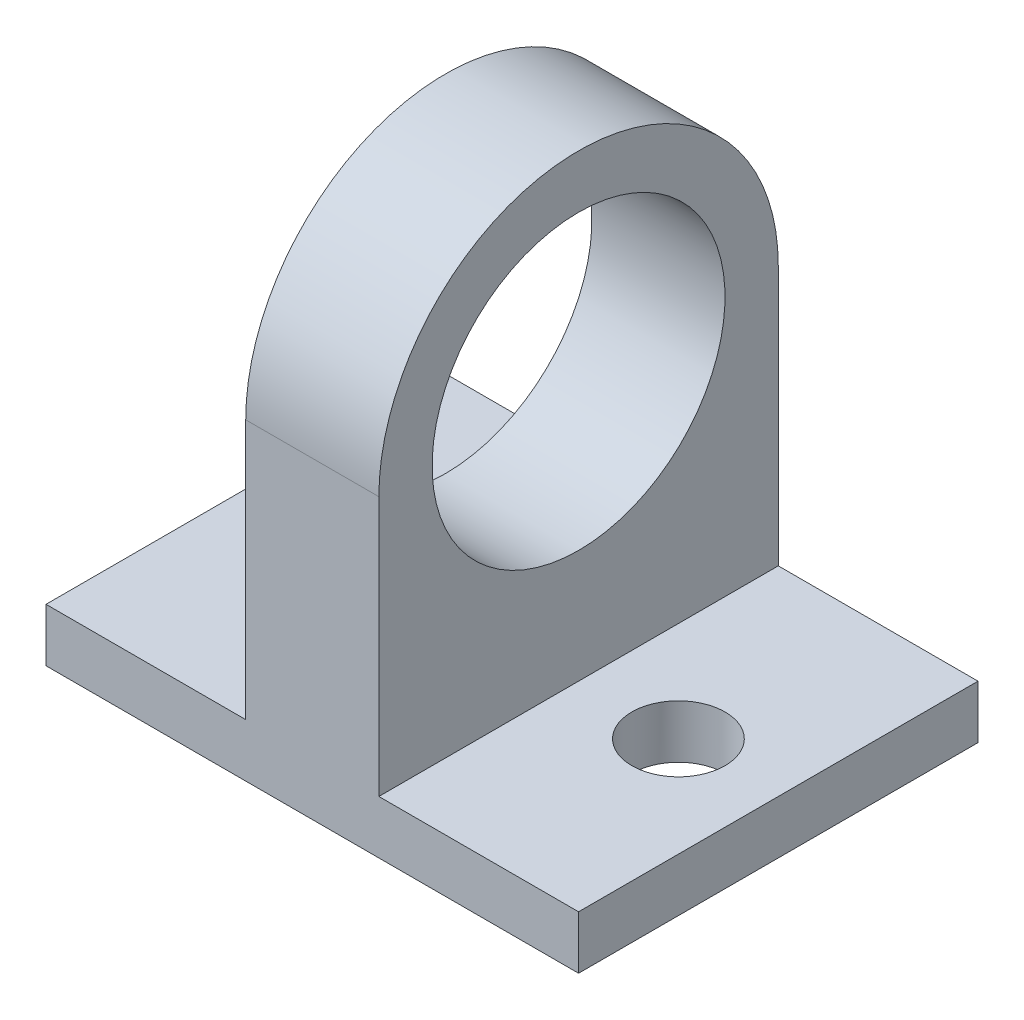
ISO-10303-21;
HEADER;
FILE_DESCRIPTION(('STEP AP214'),'2;1');
FILE_NAME('part.step','',(''),(''),'','','');
FILE_SCHEMA(('AUTOMOTIVE_DESIGN { 1 0 10303 214 1 1 1 1 }'));
ENDSEC;
DATA;
#1=APPLICATION_CONTEXT('core data for automotive mechanical design processes');
#2=APPLICATION_PROTOCOL_DEFINITION('international standard','automotive_design',2000,#1);
#3=PRODUCT_CONTEXT('',#1,'mechanical');
#4=PRODUCT('Part','Part','',(#3));
#5=PRODUCT_RELATED_PRODUCT_CATEGORY('part','',(#4));
#6=PRODUCT_DEFINITION_FORMATION('','',#4);
#7=PRODUCT_DEFINITION_CONTEXT('part definition',#1,'design');
#8=PRODUCT_DEFINITION('design','',#6,#7);
#9=PRODUCT_DEFINITION_SHAPE('','',#8);
#10=(LENGTH_UNIT() NAMED_UNIT(*) SI_UNIT(.MILLI.,.METRE.));
#11=(NAMED_UNIT(*) PLANE_ANGLE_UNIT() SI_UNIT($,.RADIAN.));
#12=(NAMED_UNIT(*) SI_UNIT($,.STERADIAN.) SOLID_ANGLE_UNIT());
#13=UNCERTAINTY_MEASURE_WITH_UNIT(LENGTH_MEASURE(1.E-05),#10,'distance_accuracy_value','');
#14=(GEOMETRIC_REPRESENTATION_CONTEXT(3) GLOBAL_UNCERTAINTY_ASSIGNED_CONTEXT((#13)) GLOBAL_UNIT_ASSIGNED_CONTEXT((#10,
#11,#12)) REPRESENTATION_CONTEXT('',''));
#15=CARTESIAN_POINT('',(0.,0.,0.));
#16=DIRECTION('',(0.,0.,1.));
#17=DIRECTION('',(1.,0.,0.));
#18=AXIS2_PLACEMENT_3D('',#15,#16,#17);
#19=CARTESIAN_POINT('',(-12.5,-41.,15.));
#20=DIRECTION('',(0.,1.,0.));
#21=DIRECTION('',(0.,0.,1.));
#22=AXIS2_PLACEMENT_3D('',#19,#20,#21);
#23=CYLINDRICAL_SURFACE('',#22,3.5);
#24=CARTESIAN_POINT('',(-12.5,-16.,15.));
#25=DIRECTION('',(0.,-1.,0.));
#26=DIRECTION('',(0.,0.,1.));
#27=AXIS2_PLACEMENT_3D('',#24,#25,#26);
#28=CIRCLE('',#27,3.5);
#29=CARTESIAN_POINT('',(-12.5,-16.,18.5));
#30=VERTEX_POINT('',#29);
#31=EDGE_CURVE('E41',#30,#30,#28,.T.);
#32=ORIENTED_EDGE('',*,*,#31,.F.);
#33=EDGE_LOOP('',(#32));
#34=FACE_BOUND('',#33,.T.);
#35=CARTESIAN_POINT('',(-12.5,-20.,15.));
#36=DIRECTION('',(0.,1.,0.));
#37=DIRECTION('',(0.,0.,-1.));
#38=AXIS2_PLACEMENT_3D('',#35,#36,#37);
#39=CIRCLE('',#38,3.5);
#40=CARTESIAN_POINT('',(-12.5,-20.,11.5));
#41=VERTEX_POINT('',#40);
#42=EDGE_CURVE('E168',#41,#41,#39,.T.);
#43=ORIENTED_EDGE('',*,*,#42,.F.);
#44=EDGE_LOOP('',(#43));
#45=FACE_BOUND('',#44,.T.);
#46=ADVANCED_FACE('F16',(#34,#45),#23,.F.);
#47=CARTESIAN_POINT('',(12.5,-41.,15.));
#48=DIRECTION('',(0.,1.,0.));
#49=DIRECTION('',(0.,0.,1.));
#50=AXIS2_PLACEMENT_3D('',#47,#48,#49);
#51=CYLINDRICAL_SURFACE('',#50,3.5);
#52=CARTESIAN_POINT('',(12.5,-16.,15.));
#53=DIRECTION('',(0.,1.,0.));
#54=DIRECTION('',(0.,0.,1.));
#55=AXIS2_PLACEMENT_3D('',#52,#53,#54);
#56=CIRCLE('',#55,3.5);
#57=CARTESIAN_POINT('',(12.5,-16.,18.5));
#58=VERTEX_POINT('',#57);
#59=EDGE_CURVE('E10',#58,#58,#56,.T.);
#60=ORIENTED_EDGE('',*,*,#59,.T.);
#61=EDGE_LOOP('',(#60));
#62=FACE_BOUND('',#61,.T.);
#63=CARTESIAN_POINT('',(12.5,-20.,15.));
#64=DIRECTION('',(0.,-1.,0.));
#65=DIRECTION('',(0.,0.,-1.));
#66=AXIS2_PLACEMENT_3D('',#63,#64,#65);
#67=CIRCLE('',#66,3.5);
#68=CARTESIAN_POINT('',(12.5,-20.,11.5));
#69=VERTEX_POINT('',#68);
#70=EDGE_CURVE('E242',#69,#69,#67,.T.);
#71=ORIENTED_EDGE('',*,*,#70,.T.);
#72=EDGE_LOOP('',(#71));
#73=FACE_BOUND('',#72,.T.);
#74=ADVANCED_FACE('F18',(#62,#73),#51,.F.);
#75=CARTESIAN_POINT('',(20.,3.5,15.));
#76=DIRECTION('',(-1.,0.,0.));
#77=DIRECTION('',(0.,-1.,0.));
#78=AXIS2_PLACEMENT_3D('',#75,#76,#77);
#79=CYLINDRICAL_SURFACE('',#78,11.);
#80=CARTESIAN_POINT('',(5.,3.5,15.));
#81=DIRECTION('',(-1.,0.,0.));
#82=DIRECTION('',(0.,-1.,0.));
#83=AXIS2_PLACEMENT_3D('',#80,#81,#82);
#84=CIRCLE('',#83,11.);
#85=CARTESIAN_POINT('',(5.,-7.5,15.));
#86=VERTEX_POINT('',#85);
#87=EDGE_CURVE('E156',#86,#86,#84,.T.);
#88=ORIENTED_EDGE('',*,*,#87,.F.);
#89=EDGE_LOOP('',(#88));
#90=FACE_BOUND('',#89,.T.);
#91=CARTESIAN_POINT('',(-5.,3.5,15.));
#92=DIRECTION('',(-1.,0.,0.));
#93=DIRECTION('',(0.,-1.,0.));
#94=AXIS2_PLACEMENT_3D('',#91,#92,#93);
#95=CIRCLE('',#94,11.);
#96=CARTESIAN_POINT('',(-5.,-7.5,15.));
#97=VERTEX_POINT('',#96);
#98=EDGE_CURVE('E174',#97,#97,#95,.T.);
#99=ORIENTED_EDGE('',*,*,#98,.T.);
#100=EDGE_LOOP('',(#99));
#101=FACE_BOUND('',#100,.T.);
#102=ADVANCED_FACE('F263',(#90,#101),#79,.F.);
#103=CARTESIAN_POINT('',(20.,3.5,15.));
#104=DIRECTION('',(-1.,0.,0.));
#105=DIRECTION('',(0.,-1.,0.));
#106=AXIS2_PLACEMENT_3D('',#103,#104,#105);
#107=CYLINDRICAL_SURFACE('',#106,15.);
#108=CARTESIAN_POINT('',(5.,3.5,15.));
#109=DIRECTION('',(-1.,0.,0.));
#110=DIRECTION('',(0.,-1.,0.));
#111=AXIS2_PLACEMENT_3D('',#108,#109,#110);
#112=CIRCLE('',#111,15.);
#113=CARTESIAN_POINT('',(5.,3.5,30.));
#114=VERTEX_POINT('',#113);
#115=CARTESIAN_POINT('',(5.,3.5,0.));
#116=VERTEX_POINT('',#115);
#117=EDGE_CURVE('E146',#114,#116,#112,.T.);
#118=ORIENTED_EDGE('',*,*,#117,.T.);
#119=DIRECTION('',(-1.,0.,0.));
#120=VECTOR('',#119,1.);
#121=CARTESIAN_POINT('',(20.,3.5,0.));
#122=LINE('',#121,#120);
#123=CARTESIAN_POINT('',(-5.,3.5,0.));
#124=VERTEX_POINT('',#123);
#125=EDGE_CURVE('E125',#116,#124,#122,.T.);
#126=ORIENTED_EDGE('',*,*,#125,.T.);
#127=CARTESIAN_POINT('',(-5.,3.5,15.));
#128=DIRECTION('',(-1.,0.,0.));
#129=DIRECTION('',(0.,-1.,0.));
#130=AXIS2_PLACEMENT_3D('',#127,#128,#129);
#131=CIRCLE('',#130,15.);
#132=CARTESIAN_POINT('',(-5.,3.5,30.));
#133=VERTEX_POINT('',#132);
#134=EDGE_CURVE('E181',#133,#124,#131,.T.);
#135=ORIENTED_EDGE('',*,*,#134,.F.);
#136=DIRECTION('',(-1.,0.,0.));
#137=VECTOR('',#136,1.);
#138=CARTESIAN_POINT('',(20.,3.5,30.));
#139=LINE('',#138,#137);
#140=EDGE_CURVE('E150',#114,#133,#139,.T.);
#141=ORIENTED_EDGE('',*,*,#140,.F.);
#142=EDGE_LOOP('',(#118,#126,#135,#141));
#143=FACE_BOUND('',#142,.T.);
#144=ADVANCED_FACE('F152',(#143),#107,.T.);
#145=CARTESIAN_POINT('',(12.5,-16.,30.));
#146=DIRECTION('',(0.,1.,0.));
#147=DIRECTION('',(1.,0.,0.));
#148=AXIS2_PLACEMENT_3D('',#145,#146,#147);
#149=PLANE('',#148);
#150=DIRECTION('',(1.,0.,0.));
#151=VECTOR('',#150,1.);
#152=CARTESIAN_POINT('',(12.5,-16.,0.));
#153=LINE('',#152,#151);
#154=CARTESIAN_POINT('',(5.,-16.,0.));
#155=VERTEX_POINT('',#154);
#156=CARTESIAN_POINT('',(20.,-16.,0.));
#157=VERTEX_POINT('',#156);
#158=EDGE_CURVE('E138',#155,#157,#153,.T.);
#159=ORIENTED_EDGE('',*,*,#158,.F.);
#160=DIRECTION('',(0.,0.,-1.));
#161=VECTOR('',#160,1.);
#162=CARTESIAN_POINT('',(5.,-16.,30.));
#163=LINE('',#162,#161);
#164=CARTESIAN_POINT('',(5.,-16.,30.));
#165=VERTEX_POINT('',#164);
#166=EDGE_CURVE('E148',#165,#155,#163,.T.);
#167=ORIENTED_EDGE('',*,*,#166,.F.);
#168=DIRECTION('',(1.,0.,0.));
#169=VECTOR('',#168,1.);
#170=CARTESIAN_POINT('',(12.5,-16.,30.));
#171=LINE('',#170,#169);
#172=CARTESIAN_POINT('',(20.,-16.,30.));
#173=VERTEX_POINT('',#172);
#174=EDGE_CURVE('E139',#165,#173,#171,.T.);
#175=ORIENTED_EDGE('',*,*,#174,.T.);
#176=DIRECTION('',(0.,0.,-1.));
#177=VECTOR('',#176,1.);
#178=CARTESIAN_POINT('',(20.,-16.,30.));
#179=LINE('',#178,#177);
#180=EDGE_CURVE('E20',#173,#157,#179,.T.);
#181=ORIENTED_EDGE('',*,*,#180,.T.);
#182=EDGE_LOOP('',(#159,#167,#175,#181));
#183=FACE_BOUND('',#182,.T.);
#184=ORIENTED_EDGE('',*,*,#59,.F.);
#185=EDGE_LOOP('',(#184));
#186=FACE_BOUND('',#185,.T.);
#187=ADVANCED_FACE('F270',(#183,#186),#149,.T.);
#188=CARTESIAN_POINT('',(20.,-18.,30.));
#189=DIRECTION('',(-1.,0.,0.));
#190=DIRECTION('',(0.,0.,1.));
#191=AXIS2_PLACEMENT_3D('',#188,#189,#190);
#192=PLANE('',#191);
#193=DIRECTION('',(0.,1.,0.));
#194=VECTOR('',#193,1.);
#195=CARTESIAN_POINT('',(20.,-18.,0.));
#196=LINE('',#195,#194);
#197=CARTESIAN_POINT('',(20.,-20.,0.));
#198=VERTEX_POINT('',#197);
#199=EDGE_CURVE('E197',#198,#157,#196,.T.);
#200=ORIENTED_EDGE('',*,*,#199,.T.);
#201=ORIENTED_EDGE('',*,*,#180,.F.);
#202=DIRECTION('',(0.,1.,0.));
#203=VECTOR('',#202,1.);
#204=CARTESIAN_POINT('',(20.,-18.,30.));
#205=LINE('',#204,#203);
#206=CARTESIAN_POINT('',(20.,-20.,30.));
#207=VERTEX_POINT('',#206);
#208=EDGE_CURVE('E169',#207,#173,#205,.T.);
#209=ORIENTED_EDGE('',*,*,#208,.F.);
#210=DIRECTION('',(0.,0.,-1.));
#211=VECTOR('',#210,1.);
#212=CARTESIAN_POINT('',(20.,-20.,30.));
#213=LINE('',#212,#211);
#214=EDGE_CURVE('E231',#207,#198,#213,.T.);
#215=ORIENTED_EDGE('',*,*,#214,.T.);
#216=EDGE_LOOP('',(#200,#201,#209,#215));
#217=FACE_BOUND('',#216,.T.);
#218=ADVANCED_FACE('F266',(#217),#192,.F.);
#219=CARTESIAN_POINT('',(-20.,-18.,30.));
#220=DIRECTION('',(-1.,0.,0.));
#221=DIRECTION('',(0.,0.,1.));
#222=AXIS2_PLACEMENT_3D('',#219,#220,#221);
#223=PLANE('',#222);
#224=DIRECTION('',(0.,1.,0.));
#225=VECTOR('',#224,1.);
#226=CARTESIAN_POINT('',(-20.,-18.,0.));
#227=LINE('',#226,#225);
#228=CARTESIAN_POINT('',(-20.,-20.,0.));
#229=VERTEX_POINT('',#228);
#230=CARTESIAN_POINT('',(-20.,-16.,0.));
#231=VERTEX_POINT('',#230);
#232=EDGE_CURVE('E211',#229,#231,#227,.T.);
#233=ORIENTED_EDGE('',*,*,#232,.F.);
#234=DIRECTION('',(0.,0.,-1.));
#235=VECTOR('',#234,1.);
#236=CARTESIAN_POINT('',(-20.,-20.,30.));
#237=LINE('',#236,#235);
#238=CARTESIAN_POINT('',(-20.,-20.,30.));
#239=VERTEX_POINT('',#238);
#240=EDGE_CURVE('E237',#239,#229,#237,.T.);
#241=ORIENTED_EDGE('',*,*,#240,.F.);
#242=DIRECTION('',(0.,1.,0.));
#243=VECTOR('',#242,1.);
#244=CARTESIAN_POINT('',(-20.,-18.,30.));
#245=LINE('',#244,#243);
#246=CARTESIAN_POINT('',(-20.,-16.,30.));
#247=VERTEX_POINT('',#246);
#248=EDGE_CURVE('E173',#239,#247,#245,.T.);
#249=ORIENTED_EDGE('',*,*,#248,.T.);
#250=DIRECTION('',(0.,0.,-1.));
#251=VECTOR('',#250,1.);
#252=CARTESIAN_POINT('',(-20.,-16.,30.));
#253=LINE('',#252,#251);
#254=EDGE_CURVE('E184',#247,#231,#253,.T.);
#255=ORIENTED_EDGE('',*,*,#254,.T.);
#256=EDGE_LOOP('',(#233,#241,#249,#255));
#257=FACE_BOUND('',#256,.T.);
#258=ADVANCED_FACE('F298',(#257),#223,.T.);
#259=CARTESIAN_POINT('',(-12.5,-16.,30.));
#260=DIRECTION('',(0.,-1.,0.));
#261=DIRECTION('',(0.,0.,-1.));
#262=AXIS2_PLACEMENT_3D('',#259,#260,#261);
#263=PLANE('',#262);
#264=DIRECTION('',(-1.,0.,0.));
#265=VECTOR('',#264,1.);
#266=CARTESIAN_POINT('',(-12.5,-16.,0.));
#267=LINE('',#266,#265);
#268=CARTESIAN_POINT('',(-5.,-16.,0.));
#269=VERTEX_POINT('',#268);
#270=EDGE_CURVE('E185',#269,#231,#267,.T.);
#271=ORIENTED_EDGE('',*,*,#270,.T.);
#272=ORIENTED_EDGE('',*,*,#254,.F.);
#273=DIRECTION('',(-1.,0.,0.));
#274=VECTOR('',#273,1.);
#275=CARTESIAN_POINT('',(-12.5,-16.,30.));
#276=LINE('',#275,#274);
#277=CARTESIAN_POINT('',(-5.,-16.,30.));
#278=VERTEX_POINT('',#277);
#279=EDGE_CURVE('E202',#278,#247,#276,.T.);
#280=ORIENTED_EDGE('',*,*,#279,.F.);
#281=DIRECTION('',(0.,0.,-1.));
#282=VECTOR('',#281,1.);
#283=CARTESIAN_POINT('',(-5.,-16.,30.));
#284=LINE('',#283,#282);
#285=EDGE_CURVE('E164',#278,#269,#284,.T.);
#286=ORIENTED_EDGE('',*,*,#285,.T.);
#287=EDGE_LOOP('',(#271,#272,#280,#286));
#288=FACE_BOUND('',#287,.T.);
#289=ORIENTED_EDGE('',*,*,#31,.T.);
#290=EDGE_LOOP('',(#289));
#291=FACE_BOUND('',#290,.T.);
#292=ADVANCED_FACE('F296',(#288,#291),#263,.F.);
#293=CARTESIAN_POINT('',(0.,0.,0.));
#294=DIRECTION('',(0.,0.,1.));
#295=DIRECTION('',(1.,0.,0.));
#296=AXIS2_PLACEMENT_3D('',#293,#294,#295);
#297=PLANE('',#296);
#298=ORIENTED_EDGE('',*,*,#125,.F.);
#299=DIRECTION('',(0.,1.,0.));
#300=VECTOR('',#299,1.);
#301=CARTESIAN_POINT('',(5.,2.,0.));
#302=LINE('',#301,#300);
#303=EDGE_CURVE('E129',#155,#116,#302,.T.);
#304=ORIENTED_EDGE('',*,*,#303,.F.);
#305=ORIENTED_EDGE('',*,*,#158,.T.);
#306=ORIENTED_EDGE('',*,*,#199,.F.);
#307=DIRECTION('',(-1.,0.,0.));
#308=VECTOR('',#307,1.);
#309=CARTESIAN_POINT('',(-12.5,-20.,0.));
#310=LINE('',#309,#308);
#311=EDGE_CURVE('E228',#198,#229,#310,.T.);
#312=ORIENTED_EDGE('',*,*,#311,.T.);
#313=ORIENTED_EDGE('',*,*,#232,.T.);
#314=ORIENTED_EDGE('',*,*,#270,.F.);
#315=DIRECTION('',(0.,1.,0.));
#316=VECTOR('',#315,1.);
#317=CARTESIAN_POINT('',(-5.,2.,0.));
#318=LINE('',#317,#316);
#319=EDGE_CURVE('E132',#269,#124,#318,.T.);
#320=ORIENTED_EDGE('',*,*,#319,.T.);
#321=EDGE_LOOP('',(#298,#304,#305,#306,#312,#313,#314,#320));
#322=FACE_BOUND('',#321,.T.);
#323=ADVANCED_FACE('F127',(#322),#297,.F.);
#324=CARTESIAN_POINT('',(0.,0.,30.));
#325=DIRECTION('',(0.,0.,1.));
#326=DIRECTION('',(1.,0.,0.));
#327=AXIS2_PLACEMENT_3D('',#324,#325,#326);
#328=PLANE('',#327);
#329=DIRECTION('',(0.,1.,0.));
#330=VECTOR('',#329,1.);
#331=CARTESIAN_POINT('',(5.,2.,30.));
#332=LINE('',#331,#330);
#333=EDGE_CURVE('E155',#165,#114,#332,.T.);
#334=ORIENTED_EDGE('',*,*,#333,.T.);
#335=ORIENTED_EDGE('',*,*,#140,.T.);
#336=DIRECTION('',(0.,1.,0.));
#337=VECTOR('',#336,1.);
#338=CARTESIAN_POINT('',(-5.,2.,30.));
#339=LINE('',#338,#337);
#340=EDGE_CURVE('E176',#278,#133,#339,.T.);
#341=ORIENTED_EDGE('',*,*,#340,.F.);
#342=ORIENTED_EDGE('',*,*,#279,.T.);
#343=ORIENTED_EDGE('',*,*,#248,.F.);
#344=DIRECTION('',(-1.,0.,0.));
#345=VECTOR('',#344,1.);
#346=CARTESIAN_POINT('',(-12.5,-20.,30.));
#347=LINE('',#346,#345);
#348=EDGE_CURVE('E234',#207,#239,#347,.T.);
#349=ORIENTED_EDGE('',*,*,#348,.F.);
#350=ORIENTED_EDGE('',*,*,#208,.T.);
#351=ORIENTED_EDGE('',*,*,#174,.F.);
#352=EDGE_LOOP('',(#334,#335,#341,#342,#343,#349,#350,#351));
#353=FACE_BOUND('',#352,.T.);
#354=ADVANCED_FACE('F290',(#353),#328,.T.);
#355=CARTESIAN_POINT('',(5.,2.,30.));
#356=DIRECTION('',(-1.,0.,0.));
#357=DIRECTION('',(0.,1.,0.));
#358=AXIS2_PLACEMENT_3D('',#355,#356,#357);
#359=PLANE('',#358);
#360=ORIENTED_EDGE('',*,*,#117,.F.);
#361=ORIENTED_EDGE('',*,*,#333,.F.);
#362=ORIENTED_EDGE('',*,*,#166,.T.);
#363=ORIENTED_EDGE('',*,*,#303,.T.);
#364=EDGE_LOOP('',(#360,#361,#362,#363));
#365=FACE_BOUND('',#364,.T.);
#366=ORIENTED_EDGE('',*,*,#87,.T.);
#367=EDGE_LOOP('',(#366));
#368=FACE_BOUND('',#367,.T.);
#369=ADVANCED_FACE('F143',(#365,#368),#359,.F.);
#370=CARTESIAN_POINT('',(-5.,2.,30.));
#371=DIRECTION('',(-1.,0.,0.));
#372=DIRECTION('',(0.,1.,0.));
#373=AXIS2_PLACEMENT_3D('',#370,#371,#372);
#374=PLANE('',#373);
#375=ORIENTED_EDGE('',*,*,#340,.T.);
#376=ORIENTED_EDGE('',*,*,#134,.T.);
#377=ORIENTED_EDGE('',*,*,#319,.F.);
#378=ORIENTED_EDGE('',*,*,#285,.F.);
#379=EDGE_LOOP('',(#375,#376,#377,#378));
#380=FACE_BOUND('',#379,.T.);
#381=ORIENTED_EDGE('',*,*,#98,.F.);
#382=EDGE_LOOP('',(#381));
#383=FACE_BOUND('',#382,.T.);
#384=ADVANCED_FACE('F281',(#380,#383),#374,.T.);
#385=CARTESIAN_POINT('',(-12.5,-20.,30.));
#386=DIRECTION('',(0.,-1.,0.));
#387=DIRECTION('',(0.,0.,-1.));
#388=AXIS2_PLACEMENT_3D('',#385,#386,#387);
#389=PLANE('',#388);
#390=ORIENTED_EDGE('',*,*,#42,.T.);
#391=EDGE_LOOP('',(#390));
#392=FACE_BOUND('',#391,.T.);
#393=ORIENTED_EDGE('',*,*,#70,.F.);
#394=EDGE_LOOP('',(#393));
#395=FACE_BOUND('',#394,.T.);
#396=ORIENTED_EDGE('',*,*,#311,.F.);
#397=ORIENTED_EDGE('',*,*,#214,.F.);
#398=ORIENTED_EDGE('',*,*,#348,.T.);
#399=ORIENTED_EDGE('',*,*,#240,.T.);
#400=EDGE_LOOP('',(#396,#397,#398,#399));
#401=FACE_BOUND('',#400,.T.);
#402=ADVANCED_FACE('F253',(#392,#395,#401),#389,.T.);
#403=CLOSED_SHELL('',(#46,#74,#102,#144,#187,#218,#258,#292,#323,#354,#369,#384,#402));
#404=MANIFOLD_SOLID_BREP('B1',#403);
#405=ADVANCED_BREP_SHAPE_REPRESENTATION('',(#18,#404),#14);
#406=SHAPE_DEFINITION_REPRESENTATION(#9,#405);
ENDSEC;
END-ISO-10303-21;
